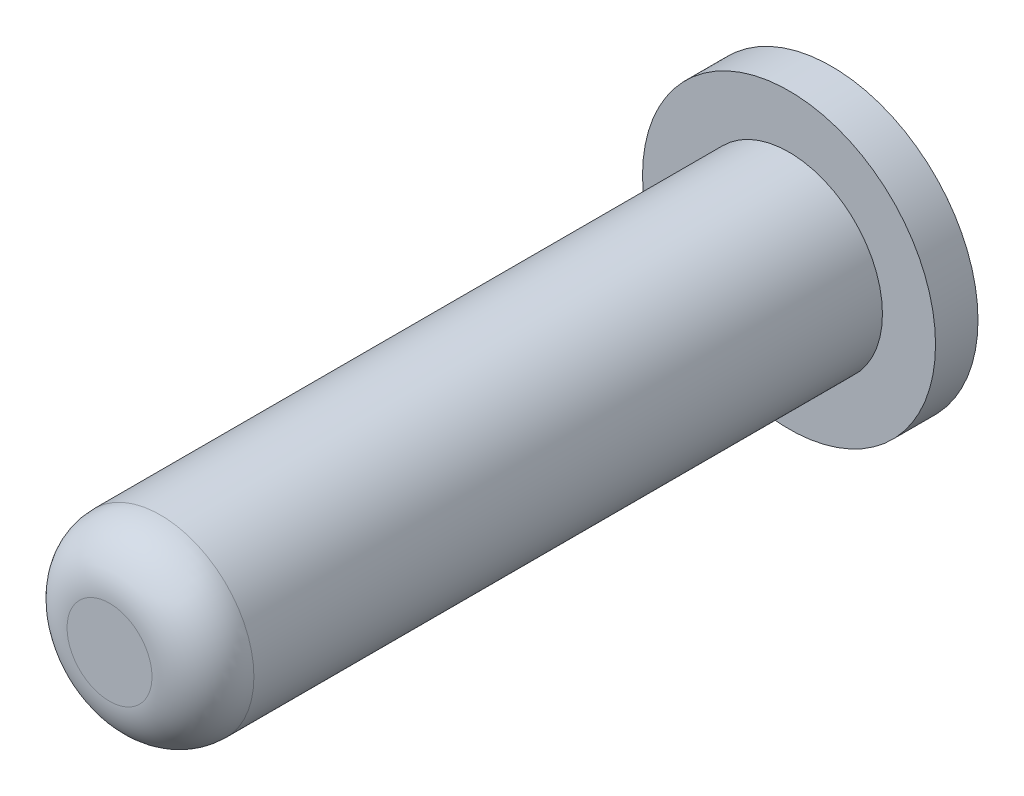
ISO-10303-21;
HEADER;
FILE_DESCRIPTION(('STEP AP214'),'2;1');
FILE_NAME('part.step','',(''),(''),'','','');
FILE_SCHEMA(('AUTOMOTIVE_DESIGN { 1 0 10303 214 1 1 1 1 }'));
ENDSEC;
DATA;
#1=APPLICATION_CONTEXT('core data for automotive mechanical design processes');
#2=APPLICATION_PROTOCOL_DEFINITION('international standard','automotive_design',2000,#1);
#3=PRODUCT_CONTEXT('',#1,'mechanical');
#4=PRODUCT('Part','Part','',(#3));
#5=PRODUCT_RELATED_PRODUCT_CATEGORY('part','',(#4));
#6=PRODUCT_DEFINITION_FORMATION('','',#4);
#7=PRODUCT_DEFINITION_CONTEXT('part definition',#1,'design');
#8=PRODUCT_DEFINITION('design','',#6,#7);
#9=PRODUCT_DEFINITION_SHAPE('','',#8);
#10=(LENGTH_UNIT() NAMED_UNIT(*) SI_UNIT(.MILLI.,.METRE.));
#11=(NAMED_UNIT(*) PLANE_ANGLE_UNIT() SI_UNIT($,.RADIAN.));
#12=(NAMED_UNIT(*) SI_UNIT($,.STERADIAN.) SOLID_ANGLE_UNIT());
#13=UNCERTAINTY_MEASURE_WITH_UNIT(LENGTH_MEASURE(1.E-05),#10,'distance_accuracy_value','');
#14=(GEOMETRIC_REPRESENTATION_CONTEXT(3) GLOBAL_UNCERTAINTY_ASSIGNED_CONTEXT((#13)) GLOBAL_UNIT_ASSIGNED_CONTEXT((#10,
#11,#12)) REPRESENTATION_CONTEXT('',''));
#15=CARTESIAN_POINT('',(0.,0.,0.));
#16=DIRECTION('',(0.,0.,1.));
#17=DIRECTION('',(1.,0.,0.));
#18=AXIS2_PLACEMENT_3D('',#15,#16,#17);
#19=CARTESIAN_POINT('',(0.,0.,0.));
#20=DIRECTION('',(0.,0.,1.));
#21=DIRECTION('',(1.,0.,0.));
#22=AXIS2_PLACEMENT_3D('',#19,#20,#21);
#23=PLANE('',#22);
#24=CARTESIAN_POINT('',(0.,0.,0.));
#25=DIRECTION('',(0.,0.,1.));
#26=DIRECTION('',(1.,0.,0.));
#27=AXIS2_PLACEMENT_3D('',#24,#25,#26);
#28=CIRCLE('',#27,1.725);
#29=CARTESIAN_POINT('',(1.725,0.,0.));
#30=VERTEX_POINT('',#29);
#31=EDGE_CURVE('E18',#30,#30,#28,.T.);
#32=ORIENTED_EDGE('',*,*,#31,.F.);
#33=EDGE_LOOP('',(#32));
#34=FACE_BOUND('',#33,.T.);
#35=ADVANCED_FACE('F14',(#34),#23,.F.);
#36=CARTESIAN_POINT('',(0.,0.,0.));
#37=DIRECTION('',(0.,0.,1.));
#38=DIRECTION('',(1.,0.,0.));
#39=AXIS2_PLACEMENT_3D('',#36,#37,#38);
#40=CYLINDRICAL_SURFACE('',#39,1.725);
#41=ORIENTED_EDGE('',*,*,#31,.T.);
#42=EDGE_LOOP('',(#41));
#43=FACE_BOUND('',#42,.T.);
#44=CARTESIAN_POINT('',(0.,0.,0.5));
#45=DIRECTION('',(0.,0.,1.));
#46=DIRECTION('',(1.,0.,0.));
#47=AXIS2_PLACEMENT_3D('',#44,#45,#46);
#48=CIRCLE('',#47,1.725);
#49=CARTESIAN_POINT('',(1.725,0.,0.5));
#50=VERTEX_POINT('',#49);
#51=EDGE_CURVE('E33',#50,#50,#48,.T.);
#52=ORIENTED_EDGE('',*,*,#51,.F.);
#53=EDGE_LOOP('',(#52));
#54=FACE_BOUND('',#53,.T.);
#55=ADVANCED_FACE('F40',(#43,#54),#40,.T.);
#56=CARTESIAN_POINT('',(0.,0.,8.5));
#57=DIRECTION('',(0.,0.,1.));
#58=DIRECTION('',(1.,0.,0.));
#59=AXIS2_PLACEMENT_3D('',#56,#57,#58);
#60=PLANE('',#59);
#61=CARTESIAN_POINT('',(0.,0.,8.5));
#62=DIRECTION('',(0.,0.,-1.));
#63=DIRECTION('',(-1.,0.,0.));
#64=AXIS2_PLACEMENT_3D('',#61,#62,#63);
#65=CIRCLE('',#64,0.5);
#66=CARTESIAN_POINT('',(-0.5,0.,8.5));
#67=VERTEX_POINT('',#66);
#68=EDGE_CURVE('E27',#67,#67,#65,.T.);
#69=ORIENTED_EDGE('',*,*,#68,.F.);
#70=EDGE_LOOP('',(#69));
#71=FACE_BOUND('',#70,.T.);
#72=ADVANCED_FACE('F48',(#71),#60,.T.);
#73=CARTESIAN_POINT('',(0.,0.,0.5));
#74=DIRECTION('',(0.,0.,1.));
#75=DIRECTION('',(1.,0.,0.));
#76=AXIS2_PLACEMENT_3D('',#73,#74,#75);
#77=PLANE('',#76);
#78=CARTESIAN_POINT('',(0.,0.,0.5));
#79=DIRECTION('',(0.,0.,1.));
#80=DIRECTION('',(1.,0.,0.));
#81=AXIS2_PLACEMENT_3D('',#78,#79,#80);
#82=CIRCLE('',#81,1.1);
#83=CARTESIAN_POINT('',(1.1,0.,0.5));
#84=VERTEX_POINT('',#83);
#85=EDGE_CURVE('E22',#84,#84,#82,.T.);
#86=ORIENTED_EDGE('',*,*,#85,.F.);
#87=EDGE_LOOP('',(#86));
#88=FACE_BOUND('',#87,.T.);
#89=ORIENTED_EDGE('',*,*,#51,.T.);
#90=EDGE_LOOP('',(#89));
#91=FACE_BOUND('',#90,.T.);
#92=ADVANCED_FACE('F56',(#88,#91),#77,.T.);
#93=CARTESIAN_POINT('',(0.,0.,7.9));
#94=DIRECTION('',(0.,0.,-1.));
#95=DIRECTION('',(-1.,0.,0.));
#96=AXIS2_PLACEMENT_3D('',#93,#94,#95);
#97=DEGENERATE_TOROIDAL_SURFACE('',#96,0.500000000000003,0.599999999999997,.T.);
#98=ORIENTED_EDGE('',*,*,#68,.T.);
#99=EDGE_LOOP('',(#98));
#100=FACE_BOUND('',#99,.T.);
#101=CARTESIAN_POINT('',(0.,0.,7.9));
#102=DIRECTION('',(0.,0.,1.));
#103=DIRECTION('',(1.,0.,0.));
#104=AXIS2_PLACEMENT_3D('',#101,#102,#103);
#105=CIRCLE('',#104,1.1);
#106=CARTESIAN_POINT('',(1.1,0.,7.9));
#107=VERTEX_POINT('',#106);
#108=EDGE_CURVE('E10',#107,#107,#105,.F.);
#109=ORIENTED_EDGE('',*,*,#108,.F.);
#110=EDGE_LOOP('',(#109));
#111=FACE_BOUND('',#110,.T.);
#112=ADVANCED_FACE('F16',(#100,#111),#97,.T.);
#113=CARTESIAN_POINT('',(0.,0.,0.5));
#114=DIRECTION('',(0.,0.,1.));
#115=DIRECTION('',(1.,0.,0.));
#116=AXIS2_PLACEMENT_3D('',#113,#114,#115);
#117=CYLINDRICAL_SURFACE('',#116,1.1);
#118=ORIENTED_EDGE('',*,*,#108,.T.);
#119=EDGE_LOOP('',(#118));
#120=FACE_BOUND('',#119,.T.);
#121=ORIENTED_EDGE('',*,*,#85,.T.);
#122=EDGE_LOOP('',(#121));
#123=FACE_BOUND('',#122,.T.);
#124=ADVANCED_FACE('F50',(#120,#123),#117,.T.);
#125=CLOSED_SHELL('',(#35,#55,#72,#92,#112,#124));
#126=MANIFOLD_SOLID_BREP('B1',#125);
#127=ADVANCED_BREP_SHAPE_REPRESENTATION('',(#18,#126),#14);
#128=SHAPE_DEFINITION_REPRESENTATION(#9,#127);
ENDSEC;
END-ISO-10303-21;
